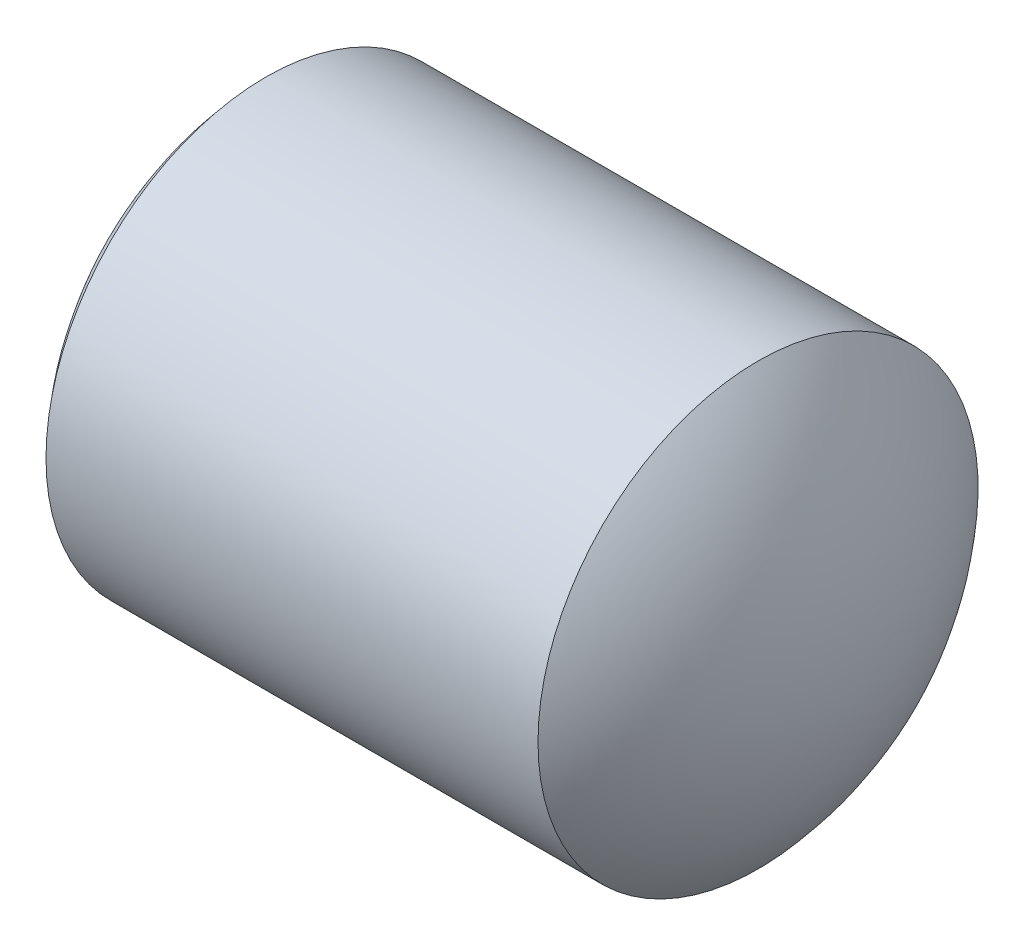
ISO-10303-21;
HEADER;
FILE_DESCRIPTION(('STEP AP214'),'2;1');
FILE_NAME('part.step','',(''),(''),'','','');
FILE_SCHEMA(('AUTOMOTIVE_DESIGN { 1 0 10303 214 1 1 1 1 }'));
ENDSEC;
DATA;
#1=APPLICATION_CONTEXT('core data for automotive mechanical design processes');
#2=APPLICATION_PROTOCOL_DEFINITION('international standard','automotive_design',2000,#1);
#3=PRODUCT_CONTEXT('',#1,'mechanical');
#4=PRODUCT('Part','Part','',(#3));
#5=PRODUCT_RELATED_PRODUCT_CATEGORY('part','',(#4));
#6=PRODUCT_DEFINITION_FORMATION('','',#4);
#7=PRODUCT_DEFINITION_CONTEXT('part definition',#1,'design');
#8=PRODUCT_DEFINITION('design','',#6,#7);
#9=PRODUCT_DEFINITION_SHAPE('','',#8);
#10=(LENGTH_UNIT() NAMED_UNIT(*) SI_UNIT(.MILLI.,.METRE.));
#11=(NAMED_UNIT(*) PLANE_ANGLE_UNIT() SI_UNIT($,.RADIAN.));
#12=(NAMED_UNIT(*) SI_UNIT($,.STERADIAN.) SOLID_ANGLE_UNIT());
#13=UNCERTAINTY_MEASURE_WITH_UNIT(LENGTH_MEASURE(1.E-05),#10,'distance_accuracy_value','');
#14=(GEOMETRIC_REPRESENTATION_CONTEXT(3) GLOBAL_UNCERTAINTY_ASSIGNED_CONTEXT((#13)) GLOBAL_UNIT_ASSIGNED_CONTEXT((#10,
#11,#12)) REPRESENTATION_CONTEXT('',''));
#15=CARTESIAN_POINT('',(0.,0.,0.));
#16=DIRECTION('',(0.,0.,1.));
#17=DIRECTION('',(1.,0.,0.));
#18=AXIS2_PLACEMENT_3D('',#15,#16,#17);
#19=CARTESIAN_POINT('',(233.990028945801,133.344863749728,0.));
#20=DIRECTION('',(-1.,0.,0.));
#21=DIRECTION('',(0.,1.,0.));
#22=AXIS2_PLACEMENT_3D('',#19,#20,#21);
#23=SPHERICAL_SURFACE('',#22,1.5);
#24=CARTESIAN_POINT('',(232.871994957051,133.344863749728,0.));
#25=DIRECTION('',(-1.,0.,0.));
#26=DIRECTION('',(0.,0.,1.));
#27=AXIS2_PLACEMENT_3D('',#24,#25,#26);
#28=CIRCLE('',#27,1.);
#29=CARTESIAN_POINT('',(232.871994957051,133.344863749728,1.));
#30=VERTEX_POINT('',#29);
#31=EDGE_CURVE('E47',#30,#30,#28,.T.);
#32=ORIENTED_EDGE('',*,*,#31,.T.);
#33=EDGE_LOOP('',(#32));
#34=FACE_BOUND('',#33,.T.);
#35=ADVANCED_FACE('F40',(#34),#23,.T.);
#36=CARTESIAN_POINT('',(233.990028945801,133.344863749728,0.));
#37=DIRECTION('',(-1.,0.,0.));
#38=DIRECTION('',(0.,1.,0.));
#39=AXIS2_PLACEMENT_3D('',#36,#37,#38);
#40=SPHERICAL_SURFACE('',#39,1.50000000000001);
#41=CARTESIAN_POINT('',(235.108062934551,133.344863749728,0.));
#42=DIRECTION('',(-1.,0.,0.));
#43=DIRECTION('',(0.,0.,1.));
#44=AXIS2_PLACEMENT_3D('',#41,#42,#43);
#45=CIRCLE('',#44,1.);
#46=CARTESIAN_POINT('',(235.108062934551,133.344863749728,1.));
#47=VERTEX_POINT('',#46);
#48=EDGE_CURVE('E10',#47,#47,#45,.T.);
#49=ORIENTED_EDGE('',*,*,#48,.F.);
#50=EDGE_LOOP('',(#49));
#51=FACE_BOUND('',#50,.T.);
#52=ADVANCED_FACE('F57',(#51),#40,.T.);
#53=CARTESIAN_POINT('',(232.24849204411,133.344863749728,0.));
#54=DIRECTION('',(-1.,0.,0.));
#55=DIRECTION('',(0.,0.,1.));
#56=AXIS2_PLACEMENT_3D('',#53,#54,#55);
#57=CYLINDRICAL_SURFACE('',#56,1.);
#58=ORIENTED_EDGE('',*,*,#48,.T.);
#59=EDGE_LOOP('',(#58));
#60=FACE_BOUND('',#59,.T.);
#61=ORIENTED_EDGE('',*,*,#31,.F.);
#62=EDGE_LOOP('',(#61));
#63=FACE_BOUND('',#62,.T.);
#64=ADVANCED_FACE('F55',(#60,#63),#57,.T.);
#65=CLOSED_SHELL('',(#35,#52,#64));
#66=MANIFOLD_SOLID_BREP('B2',#65);
#67=ADVANCED_BREP_SHAPE_REPRESENTATION('',(#18,#66),#14);
#68=SHAPE_DEFINITION_REPRESENTATION(#9,#67);
ENDSEC;
END-ISO-10303-21;
